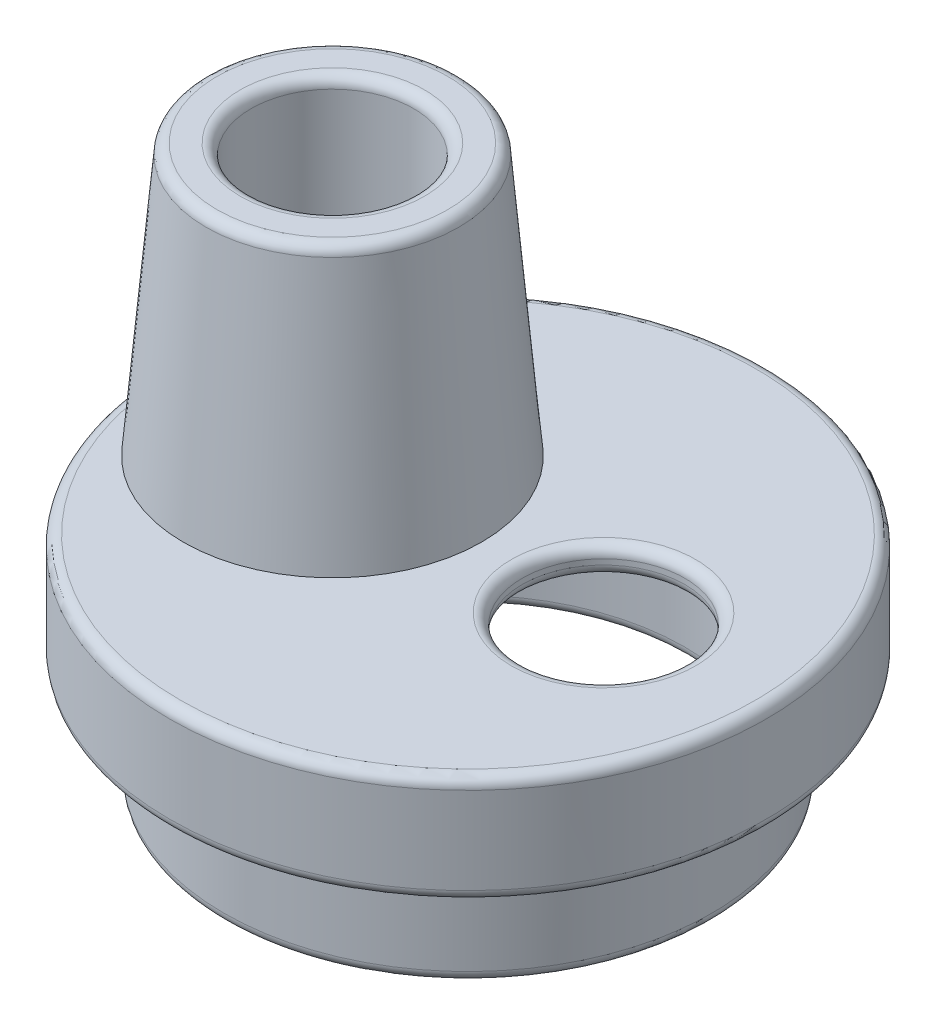
ISO-10303-21;
HEADER;
FILE_DESCRIPTION(('STEP AP214'),'2;1');
FILE_NAME('part.step','',(''),(''),'','','');
FILE_SCHEMA(('AUTOMOTIVE_DESIGN { 1 0 10303 214 1 1 1 1 }'));
ENDSEC;
DATA;
#1=APPLICATION_CONTEXT('core data for automotive mechanical design processes');
#2=APPLICATION_PROTOCOL_DEFINITION('international standard','automotive_design',2000,#1);
#3=PRODUCT_CONTEXT('',#1,'mechanical');
#4=PRODUCT('Part','Part','',(#3));
#5=PRODUCT_RELATED_PRODUCT_CATEGORY('part','',(#4));
#6=PRODUCT_DEFINITION_FORMATION('','',#4);
#7=PRODUCT_DEFINITION_CONTEXT('part definition',#1,'design');
#8=PRODUCT_DEFINITION('design','',#6,#7);
#9=PRODUCT_DEFINITION_SHAPE('','',#8);
#10=(LENGTH_UNIT() NAMED_UNIT(*) SI_UNIT(.MILLI.,.METRE.));
#11=(NAMED_UNIT(*) PLANE_ANGLE_UNIT() SI_UNIT($,.RADIAN.));
#12=(NAMED_UNIT(*) SI_UNIT($,.STERADIAN.) SOLID_ANGLE_UNIT());
#13=UNCERTAINTY_MEASURE_WITH_UNIT(LENGTH_MEASURE(1.E-05),#10,'distance_accuracy_value','');
#14=(GEOMETRIC_REPRESENTATION_CONTEXT(3) GLOBAL_UNCERTAINTY_ASSIGNED_CONTEXT((#13)) GLOBAL_UNIT_ASSIGNED_CONTEXT((#10,
#11,#12)) REPRESENTATION_CONTEXT('',''));
#15=CARTESIAN_POINT('',(0.,0.,0.));
#16=DIRECTION('',(0.,0.,1.));
#17=DIRECTION('',(1.,0.,0.));
#18=AXIS2_PLACEMENT_3D('',#15,#16,#17);
#19=CARTESIAN_POINT('',(0.,0.,0.));
#20=DIRECTION('',(0.,1.,0.));
#21=DIRECTION('',(0.,0.,1.));
#22=AXIS2_PLACEMENT_3D('',#19,#20,#21);
#23=PLANE('',#22);
#24=CARTESIAN_POINT('',(2.5,0.,0.));
#25=DIRECTION('',(0.,1.,0.));
#26=DIRECTION('',(0.,0.,1.));
#27=AXIS2_PLACEMENT_3D('',#24,#25,#26);
#28=CIRCLE('',#27,1.7);
#29=CARTESIAN_POINT('',(2.5,0.,1.7));
#30=VERTEX_POINT('',#29);
#31=EDGE_CURVE('E47',#30,#30,#28,.F.);
#32=ORIENTED_EDGE('',*,*,#31,.T.);
#33=EDGE_LOOP('',(#32));
#34=FACE_BOUND('',#33,.T.);
#35=CARTESIAN_POINT('',(0.,0.,0.));
#36=DIRECTION('',(0.,1.,0.));
#37=DIRECTION('',(0.,0.,1.));
#38=AXIS2_PLACEMENT_3D('',#35,#36,#37);
#39=CIRCLE('',#38,5.3);
#40=CARTESIAN_POINT('',(0.,0.,5.3));
#41=VERTEX_POINT('',#40);
#42=EDGE_CURVE('E52',#41,#41,#39,.T.);
#43=ORIENTED_EDGE('',*,*,#42,.T.);
#44=EDGE_LOOP('',(#43));
#45=FACE_BOUND('',#44,.T.);
#46=CARTESIAN_POINT('',(-2.5,0.,0.));
#47=DIRECTION('',(0.,1.,0.));
#48=DIRECTION('',(0.,0.,1.));
#49=AXIS2_PLACEMENT_3D('',#46,#47,#48);
#50=CIRCLE('',#49,2.75);
#51=CARTESIAN_POINT('',(-2.5,0.,2.75));
#52=VERTEX_POINT('',#51);
#53=EDGE_CURVE('E106',#52,#52,#50,.T.);
#54=ORIENTED_EDGE('',*,*,#53,.F.);
#55=EDGE_LOOP('',(#54));
#56=FACE_BOUND('',#55,.T.);
#57=ADVANCED_FACE('F32',(#34,#45,#56),#23,.T.);
#58=CARTESIAN_POINT('',(0.,0.,0.));
#59=DIRECTION('',(0.,1.,0.));
#60=DIRECTION('',(0.,0.,1.));
#61=AXIS2_PLACEMENT_3D('',#58,#59,#60);
#62=CYLINDRICAL_SURFACE('',#61,5.5);
#63=CARTESIAN_POINT('',(0.,-1.8,0.));
#64=DIRECTION('',(0.,-1.,0.));
#65=DIRECTION('',(0.,0.,-1.));
#66=AXIS2_PLACEMENT_3D('',#63,#64,#65);
#67=CIRCLE('',#66,5.5);
#68=CARTESIAN_POINT('',(0.,-1.8,-5.5));
#69=VERTEX_POINT('',#68);
#70=EDGE_CURVE('E64',#69,#69,#67,.F.);
#71=ORIENTED_EDGE('',*,*,#70,.T.);
#72=EDGE_LOOP('',(#71));
#73=FACE_BOUND('',#72,.T.);
#74=CARTESIAN_POINT('',(0.,-0.2,0.));
#75=DIRECTION('',(0.,1.,0.));
#76=DIRECTION('',(0.,0.,1.));
#77=AXIS2_PLACEMENT_3D('',#74,#75,#76);
#78=CIRCLE('',#77,5.5);
#79=CARTESIAN_POINT('',(0.,-0.200000000000001,5.5));
#80=VERTEX_POINT('',#79);
#81=EDGE_CURVE('E67',#80,#80,#78,.F.);
#82=ORIENTED_EDGE('',*,*,#81,.T.);
#83=EDGE_LOOP('',(#82));
#84=FACE_BOUND('',#83,.T.);
#85=ADVANCED_FACE('F113',(#73,#84),#62,.T.);
#86=CARTESIAN_POINT('',(0.,-2.,5.5));
#87=DIRECTION('',(0.,-1.,0.));
#88=DIRECTION('',(0.,0.,-1.));
#89=AXIS2_PLACEMENT_3D('',#86,#87,#88);
#90=PLANE('',#89);
#91=CARTESIAN_POINT('',(0.,-2.,0.));
#92=DIRECTION('',(0.,-1.,0.));
#93=DIRECTION('',(0.,0.,-1.));
#94=AXIS2_PLACEMENT_3D('',#91,#92,#93);
#95=CIRCLE('',#94,5.3);
#96=CARTESIAN_POINT('',(0.,-2.,-5.3));
#97=VERTEX_POINT('',#96);
#98=EDGE_CURVE('E61',#97,#97,#95,.T.);
#99=ORIENTED_EDGE('',*,*,#98,.T.);
#100=EDGE_LOOP('',(#99));
#101=FACE_BOUND('',#100,.T.);
#102=CARTESIAN_POINT('',(0.,-2.,0.));
#103=DIRECTION('',(0.,1.,0.));
#104=DIRECTION('',(0.,0.,1.));
#105=AXIS2_PLACEMENT_3D('',#102,#103,#104);
#106=CIRCLE('',#105,4.5);
#107=CARTESIAN_POINT('',(0.,-2.,4.5));
#108=VERTEX_POINT('',#107);
#109=EDGE_CURVE('E94',#108,#108,#106,.T.);
#110=ORIENTED_EDGE('',*,*,#109,.T.);
#111=EDGE_LOOP('',(#110));
#112=FACE_BOUND('',#111,.T.);
#113=ADVANCED_FACE('F119',(#101,#112),#90,.T.);
#114=CARTESIAN_POINT('',(0.,0.,0.));
#115=DIRECTION('',(0.,1.,0.));
#116=DIRECTION('',(0.,0.,1.));
#117=AXIS2_PLACEMENT_3D('',#114,#115,#116);
#118=CYLINDRICAL_SURFACE('',#117,4.5);
#119=CARTESIAN_POINT('',(0.,-3.8,0.));
#120=DIRECTION('',(0.,-1.,0.));
#121=DIRECTION('',(0.,0.,-1.));
#122=AXIS2_PLACEMENT_3D('',#119,#120,#121);
#123=CIRCLE('',#122,4.5);
#124=CARTESIAN_POINT('',(0.,-3.8,-4.5));
#125=VERTEX_POINT('',#124);
#126=EDGE_CURVE('E70',#125,#125,#123,.F.);
#127=ORIENTED_EDGE('',*,*,#126,.T.);
#128=EDGE_LOOP('',(#127));
#129=FACE_BOUND('',#128,.T.);
#130=ORIENTED_EDGE('',*,*,#109,.F.);
#131=EDGE_LOOP('',(#130));
#132=FACE_BOUND('',#131,.T.);
#133=ADVANCED_FACE('F198',(#129,#132),#118,.T.);
#134=CARTESIAN_POINT('',(0.,-4.,4.));
#135=DIRECTION('',(0.,-1.,0.));
#136=DIRECTION('',(0.,0.,-1.));
#137=AXIS2_PLACEMENT_3D('',#134,#135,#136);
#138=PLANE('',#137);
#139=CARTESIAN_POINT('',(0.,-4.,0.));
#140=DIRECTION('',(0.,-1.,0.));
#141=DIRECTION('',(0.,0.,-1.));
#142=AXIS2_PLACEMENT_3D('',#139,#140,#141);
#143=CIRCLE('',#142,4.2);
#144=CARTESIAN_POINT('',(0.,-4.,-4.2));
#145=VERTEX_POINT('',#144);
#146=EDGE_CURVE('E76',#145,#145,#143,.F.);
#147=ORIENTED_EDGE('',*,*,#146,.T.);
#148=EDGE_LOOP('',(#147));
#149=FACE_BOUND('',#148,.T.);
#150=CARTESIAN_POINT('',(0.,-4.,0.));
#151=DIRECTION('',(0.,-1.,0.));
#152=DIRECTION('',(0.,0.,-1.));
#153=AXIS2_PLACEMENT_3D('',#150,#151,#152);
#154=CIRCLE('',#153,4.3);
#155=CARTESIAN_POINT('',(0.,-4.,-4.3));
#156=VERTEX_POINT('',#155);
#157=EDGE_CURVE('E79',#156,#156,#154,.T.);
#158=ORIENTED_EDGE('',*,*,#157,.T.);
#159=EDGE_LOOP('',(#158));
#160=FACE_BOUND('',#159,.T.);
#161=ADVANCED_FACE('F194',(#149,#160),#138,.T.);
#162=CARTESIAN_POINT('',(0.,0.,0.));
#163=DIRECTION('',(0.,1.,0.));
#164=DIRECTION('',(0.,0.,1.));
#165=AXIS2_PLACEMENT_3D('',#162,#163,#164);
#166=CYLINDRICAL_SURFACE('',#165,4.);
#167=CARTESIAN_POINT('',(0.,-3.8,0.));
#168=DIRECTION('',(0.,-1.,0.));
#169=DIRECTION('',(0.,0.,-1.));
#170=AXIS2_PLACEMENT_3D('',#167,#168,#169);
#171=CIRCLE('',#170,4.);
#172=CARTESIAN_POINT('',(0.,-3.8,-4.));
#173=VERTEX_POINT('',#172);
#174=EDGE_CURVE('E73',#173,#173,#171,.T.);
#175=ORIENTED_EDGE('',*,*,#174,.T.);
#176=EDGE_LOOP('',(#175));
#177=FACE_BOUND('',#176,.T.);
#178=CARTESIAN_POINT('',(0.,-1.5,0.));
#179=DIRECTION('',(0.,1.,0.));
#180=DIRECTION('',(0.,0.,1.));
#181=AXIS2_PLACEMENT_3D('',#178,#179,#180);
#182=CIRCLE('',#181,4.);
#183=CARTESIAN_POINT('',(0.,-1.5,4.));
#184=VERTEX_POINT('',#183);
#185=EDGE_CURVE('E97',#184,#184,#182,.T.);
#186=ORIENTED_EDGE('',*,*,#185,.T.);
#187=EDGE_LOOP('',(#186));
#188=FACE_BOUND('',#187,.T.);
#189=ADVANCED_FACE('F190',(#177,#188),#166,.F.);
#190=CARTESIAN_POINT('',(0.,-1.5,5.));
#191=DIRECTION('',(0.,1.,0.));
#192=DIRECTION('',(0.,0.,1.));
#193=AXIS2_PLACEMENT_3D('',#190,#191,#192);
#194=PLANE('',#193);
#195=CARTESIAN_POINT('',(0.,-1.5,0.));
#196=DIRECTION('',(0.,1.,0.));
#197=DIRECTION('',(0.,0.,1.));
#198=AXIS2_PLACEMENT_3D('',#195,#196,#197);
#199=CIRCLE('',#198,5.);
#200=CARTESIAN_POINT('',(0.,-1.5,5.));
#201=VERTEX_POINT('',#200);
#202=EDGE_CURVE('E100',#201,#201,#199,.T.);
#203=ORIENTED_EDGE('',*,*,#202,.T.);
#204=EDGE_LOOP('',(#203));
#205=FACE_BOUND('',#204,.T.);
#206=ORIENTED_EDGE('',*,*,#185,.F.);
#207=EDGE_LOOP('',(#206));
#208=FACE_BOUND('',#207,.T.);
#209=ADVANCED_FACE('F186',(#205,#208),#194,.T.);
#210=CARTESIAN_POINT('',(0.,0.,0.));
#211=DIRECTION('',(0.,1.,0.));
#212=DIRECTION('',(0.,0.,1.));
#213=AXIS2_PLACEMENT_3D('',#210,#211,#212);
#214=CYLINDRICAL_SURFACE('',#213,5.);
#215=CARTESIAN_POINT('',(0.,-0.499999999999999,0.));
#216=DIRECTION('',(0.,1.,0.));
#217=DIRECTION('',(0.,0.,1.));
#218=AXIS2_PLACEMENT_3D('',#215,#216,#217);
#219=CIRCLE('',#218,5.);
#220=CARTESIAN_POINT('',(0.,-0.5,5.));
#221=VERTEX_POINT('',#220);
#222=EDGE_CURVE('E103',#221,#221,#219,.T.);
#223=ORIENTED_EDGE('',*,*,#222,.T.);
#224=EDGE_LOOP('',(#223));
#225=FACE_BOUND('',#224,.T.);
#226=ORIENTED_EDGE('',*,*,#202,.F.);
#227=EDGE_LOOP('',(#226));
#228=FACE_BOUND('',#227,.T.);
#229=ADVANCED_FACE('F182',(#225,#228),#214,.F.);
#230=CARTESIAN_POINT('',(0.,-0.5,0.));
#231=DIRECTION('',(0.,-1.,0.));
#232=DIRECTION('',(0.,0.,-1.));
#233=AXIS2_PLACEMENT_3D('',#230,#231,#232);
#234=PLANE('',#233);
#235=CARTESIAN_POINT('',(-2.5,-0.5,0.));
#236=DIRECTION('',(0.,-1.,0.));
#237=DIRECTION('',(0.,0.,-1.));
#238=AXIS2_PLACEMENT_3D('',#235,#236,#237);
#239=CIRCLE('',#238,1.7);
#240=CARTESIAN_POINT('',(-2.5,-0.499999999999999,-1.7));
#241=VERTEX_POINT('',#240);
#242=EDGE_CURVE('E88',#241,#241,#239,.F.);
#243=ORIENTED_EDGE('',*,*,#242,.T.);
#244=EDGE_LOOP('',(#243));
#245=FACE_BOUND('',#244,.T.);
#246=CARTESIAN_POINT('',(2.5,-0.5,0.));
#247=DIRECTION('',(0.,-1.,0.));
#248=DIRECTION('',(0.,0.,-1.));
#249=AXIS2_PLACEMENT_3D('',#246,#247,#248);
#250=CIRCLE('',#249,1.7);
#251=CARTESIAN_POINT('',(2.5,-0.499999999999999,-1.7));
#252=VERTEX_POINT('',#251);
#253=EDGE_CURVE('E91',#252,#252,#250,.F.);
#254=ORIENTED_EDGE('',*,*,#253,.T.);
#255=EDGE_LOOP('',(#254));
#256=FACE_BOUND('',#255,.T.);
#257=ORIENTED_EDGE('',*,*,#222,.F.);
#258=EDGE_LOOP('',(#257));
#259=FACE_BOUND('',#258,.T.);
#260=ADVANCED_FACE('F176',(#245,#256,#259),#234,.T.);
#261=CARTESIAN_POINT('',(2.5,-4.001,0.));
#262=DIRECTION('',(0.,1.,0.));
#263=DIRECTION('',(0.,0.,1.));
#264=AXIS2_PLACEMENT_3D('',#261,#262,#263);
#265=CYLINDRICAL_SURFACE('',#264,1.5);
#266=CARTESIAN_POINT('',(2.5,-0.299999999999999,0.));
#267=DIRECTION('',(0.,-1.,0.));
#268=DIRECTION('',(0.,0.,-1.));
#269=AXIS2_PLACEMENT_3D('',#266,#267,#268);
#270=CIRCLE('',#269,1.5);
#271=CARTESIAN_POINT('',(2.5,-0.299999999999999,-1.5));
#272=VERTEX_POINT('',#271);
#273=EDGE_CURVE('E55',#272,#272,#270,.T.);
#274=ORIENTED_EDGE('',*,*,#273,.T.);
#275=EDGE_LOOP('',(#274));
#276=FACE_BOUND('',#275,.T.);
#277=CARTESIAN_POINT('',(2.5,-0.200000000000001,0.));
#278=DIRECTION('',(0.,1.,0.));
#279=DIRECTION('',(0.,0.,1.));
#280=AXIS2_PLACEMENT_3D('',#277,#278,#279);
#281=CIRCLE('',#280,1.5);
#282=CARTESIAN_POINT('',(2.5,-0.200000000000001,1.5));
#283=VERTEX_POINT('',#282);
#284=EDGE_CURVE('E58',#283,#283,#281,.T.);
#285=ORIENTED_EDGE('',*,*,#284,.T.);
#286=EDGE_LOOP('',(#285));
#287=FACE_BOUND('',#286,.T.);
#288=ADVANCED_FACE('F168',(#276,#287),#265,.F.);
#289=CARTESIAN_POINT('',(-2.5,-4.001,0.));
#290=DIRECTION('',(0.,1.,0.));
#291=DIRECTION('',(0.,0.,1.));
#292=AXIS2_PLACEMENT_3D('',#289,#290,#291);
#293=CYLINDRICAL_SURFACE('',#292,1.5);
#294=CARTESIAN_POINT('',(-2.5,-0.299999999999999,0.));
#295=DIRECTION('',(0.,-1.,0.));
#296=DIRECTION('',(0.,0.,-1.));
#297=AXIS2_PLACEMENT_3D('',#294,#295,#296);
#298=CIRCLE('',#297,1.5);
#299=CARTESIAN_POINT('',(-2.5,-0.299999999999999,-1.5));
#300=VERTEX_POINT('',#299);
#301=EDGE_CURVE('E82',#300,#300,#298,.T.);
#302=ORIENTED_EDGE('',*,*,#301,.T.);
#303=EDGE_LOOP('',(#302));
#304=FACE_BOUND('',#303,.T.);
#305=CARTESIAN_POINT('',(-2.5,4.8,0.));
#306=DIRECTION('',(0.,1.,0.));
#307=DIRECTION('',(0.,0.,1.));
#308=AXIS2_PLACEMENT_3D('',#305,#306,#307);
#309=CIRCLE('',#308,1.5);
#310=CARTESIAN_POINT('',(-2.5,4.8,1.5));
#311=VERTEX_POINT('',#310);
#312=EDGE_CURVE('E85',#311,#311,#309,.T.);
#313=ORIENTED_EDGE('',*,*,#312,.T.);
#314=EDGE_LOOP('',(#313));
#315=FACE_BOUND('',#314,.T.);
#316=ADVANCED_FACE('F166',(#304,#315),#293,.F.);
#317=CARTESIAN_POINT('',(-2.5,5.,0.));
#318=DIRECTION('',(0.,1.,0.));
#319=DIRECTION('',(0.,0.,1.));
#320=AXIS2_PLACEMENT_3D('',#317,#318,#319);
#321=PLANE('',#320);
#322=CARTESIAN_POINT('',(-2.5,5.,0.));
#323=DIRECTION('',(0.,1.,0.));
#324=DIRECTION('',(0.,0.,1.));
#325=AXIS2_PLACEMENT_3D('',#322,#323,#324);
#326=CIRCLE('',#325,2.12929044756689);
#327=CARTESIAN_POINT('',(-2.5,5.,2.1292904475669));
#328=VERTEX_POINT('',#327);
#329=EDGE_CURVE('E39',#328,#328,#326,.T.);
#330=ORIENTED_EDGE('',*,*,#329,.T.);
#331=EDGE_LOOP('',(#330));
#332=FACE_BOUND('',#331,.T.);
#333=CARTESIAN_POINT('',(-2.5,5.,0.));
#334=DIRECTION('',(0.,1.,0.));
#335=DIRECTION('',(0.,0.,1.));
#336=AXIS2_PLACEMENT_3D('',#333,#334,#335);
#337=CIRCLE('',#336,1.7);
#338=CARTESIAN_POINT('',(-2.5,5.,1.7));
#339=VERTEX_POINT('',#338);
#340=EDGE_CURVE('E43',#339,#339,#337,.F.);
#341=ORIENTED_EDGE('',*,*,#340,.T.);
#342=EDGE_LOOP('',(#341));
#343=FACE_BOUND('',#342,.T.);
#344=ADVANCED_FACE('F128',(#332,#343),#321,.T.);
#345=CARTESIAN_POINT('',(-2.5,0.,0.));
#346=DIRECTION('',(0.,-1.,0.));
#347=DIRECTION('',(0.,0.,1.));
#348=AXIS2_PLACEMENT_3D('',#345,#346,#347);
#349=CONICAL_SURFACE('',#348,2.75,0.0872664625997165);
#350=CARTESIAN_POINT('',(-2.5,4.81743114854953,0.));
#351=DIRECTION('',(0.,-1.,0.));
#352=DIRECTION('',(0.,0.,-1.));
#353=AXIS2_PLACEMENT_3D('',#350,#351,#352);
#354=CIRCLE('',#353,2.32852938718524);
#355=CARTESIAN_POINT('',(-2.5,4.81743114854953,-2.32852938718524));
#356=VERTEX_POINT('',#355);
#357=EDGE_CURVE('E10',#356,#356,#354,.T.);
#358=ORIENTED_EDGE('',*,*,#357,.T.);
#359=EDGE_LOOP('',(#358));
#360=FACE_BOUND('',#359,.T.);
#361=ORIENTED_EDGE('',*,*,#53,.T.);
#362=EDGE_LOOP('',(#361));
#363=FACE_BOUND('',#362,.T.);
#364=ADVANCED_FACE('F110',(#360,#363),#349,.T.);
#365=CARTESIAN_POINT('',(-2.5,-0.3,0.));
#366=DIRECTION('',(0.,-1.,0.));
#367=DIRECTION('',(0.,0.,-1.));
#368=AXIS2_PLACEMENT_3D('',#365,#366,#367);
#369=TOROIDAL_SURFACE('',#368,1.7,0.2);
#370=ORIENTED_EDGE('',*,*,#301,.F.);
#371=EDGE_LOOP('',(#370));
#372=FACE_BOUND('',#371,.T.);
#373=ORIENTED_EDGE('',*,*,#242,.F.);
#374=EDGE_LOOP('',(#373));
#375=FACE_BOUND('',#374,.T.);
#376=ADVANCED_FACE('F127',(#372,#375),#369,.T.);
#377=CARTESIAN_POINT('',(0.,-3.8,0.));
#378=DIRECTION('',(0.,-1.,0.));
#379=DIRECTION('',(0.,0.,-1.));
#380=AXIS2_PLACEMENT_3D('',#377,#378,#379);
#381=TOROIDAL_SURFACE('',#380,4.2,0.2);
#382=ORIENTED_EDGE('',*,*,#174,.F.);
#383=EDGE_LOOP('',(#382));
#384=FACE_BOUND('',#383,.T.);
#385=ORIENTED_EDGE('',*,*,#146,.F.);
#386=EDGE_LOOP('',(#385));
#387=FACE_BOUND('',#386,.T.);
#388=ADVANCED_FACE('F131',(#384,#387),#381,.T.);
#389=CARTESIAN_POINT('',(0.,-3.8,0.));
#390=DIRECTION('',(0.,-1.,0.));
#391=DIRECTION('',(0.,0.,-1.));
#392=AXIS2_PLACEMENT_3D('',#389,#390,#391);
#393=TOROIDAL_SURFACE('',#392,4.3,0.2);
#394=ORIENTED_EDGE('',*,*,#157,.F.);
#395=EDGE_LOOP('',(#394));
#396=FACE_BOUND('',#395,.T.);
#397=ORIENTED_EDGE('',*,*,#126,.F.);
#398=EDGE_LOOP('',(#397));
#399=FACE_BOUND('',#398,.T.);
#400=ADVANCED_FACE('F135',(#396,#399),#393,.T.);
#401=CARTESIAN_POINT('',(0.,-1.8,0.));
#402=DIRECTION('',(0.,-1.,0.));
#403=DIRECTION('',(0.,0.,-1.));
#404=AXIS2_PLACEMENT_3D('',#401,#402,#403);
#405=TOROIDAL_SURFACE('',#404,5.3,0.2);
#406=ORIENTED_EDGE('',*,*,#98,.F.);
#407=EDGE_LOOP('',(#406));
#408=FACE_BOUND('',#407,.T.);
#409=ORIENTED_EDGE('',*,*,#70,.F.);
#410=EDGE_LOOP('',(#409));
#411=FACE_BOUND('',#410,.T.);
#412=ADVANCED_FACE('F139',(#408,#411),#405,.T.);
#413=CARTESIAN_POINT('',(2.5,-0.3,0.));
#414=DIRECTION('',(0.,-1.,0.));
#415=DIRECTION('',(0.,0.,-1.));
#416=AXIS2_PLACEMENT_3D('',#413,#414,#415);
#417=TOROIDAL_SURFACE('',#416,1.7,0.2);
#418=ORIENTED_EDGE('',*,*,#273,.F.);
#419=EDGE_LOOP('',(#418));
#420=FACE_BOUND('',#419,.T.);
#421=ORIENTED_EDGE('',*,*,#253,.F.);
#422=EDGE_LOOP('',(#421));
#423=FACE_BOUND('',#422,.T.);
#424=ADVANCED_FACE('F143',(#420,#423),#417,.T.);
#425=CARTESIAN_POINT('',(2.5,-0.2,0.));
#426=DIRECTION('',(0.,1.,0.));
#427=DIRECTION('',(0.,0.,1.));
#428=AXIS2_PLACEMENT_3D('',#425,#426,#427);
#429=TOROIDAL_SURFACE('',#428,1.7,0.2);
#430=ORIENTED_EDGE('',*,*,#31,.F.);
#431=EDGE_LOOP('',(#430));
#432=FACE_BOUND('',#431,.T.);
#433=ORIENTED_EDGE('',*,*,#284,.F.);
#434=EDGE_LOOP('',(#433));
#435=FACE_BOUND('',#434,.T.);
#436=ADVANCED_FACE('F147',(#432,#435),#429,.T.);
#437=CARTESIAN_POINT('',(-2.5,4.8,0.));
#438=DIRECTION('',(0.,1.,0.));
#439=DIRECTION('',(0.,0.,1.));
#440=AXIS2_PLACEMENT_3D('',#437,#438,#439);
#441=TOROIDAL_SURFACE('',#440,2.12929044756689,0.2);
#442=ORIENTED_EDGE('',*,*,#357,.F.);
#443=EDGE_LOOP('',(#442));
#444=FACE_BOUND('',#443,.T.);
#445=ORIENTED_EDGE('',*,*,#329,.F.);
#446=EDGE_LOOP('',(#445));
#447=FACE_BOUND('',#446,.T.);
#448=ADVANCED_FACE('F151',(#444,#447),#441,.T.);
#449=CARTESIAN_POINT('',(-2.5,4.8,0.));
#450=DIRECTION('',(0.,1.,0.));
#451=DIRECTION('',(0.,0.,1.));
#452=AXIS2_PLACEMENT_3D('',#449,#450,#451);
#453=TOROIDAL_SURFACE('',#452,1.7,0.2);
#454=ORIENTED_EDGE('',*,*,#340,.F.);
#455=EDGE_LOOP('',(#454));
#456=FACE_BOUND('',#455,.T.);
#457=ORIENTED_EDGE('',*,*,#312,.F.);
#458=EDGE_LOOP('',(#457));
#459=FACE_BOUND('',#458,.T.);
#460=ADVANCED_FACE('F154',(#456,#459),#453,.T.);
#461=CARTESIAN_POINT('',(0.,-0.2,0.));
#462=DIRECTION('',(0.,1.,0.));
#463=DIRECTION('',(0.,0.,1.));
#464=AXIS2_PLACEMENT_3D('',#461,#462,#463);
#465=TOROIDAL_SURFACE('',#464,5.3,0.2);
#466=ORIENTED_EDGE('',*,*,#81,.F.);
#467=EDGE_LOOP('',(#466));
#468=FACE_BOUND('',#467,.T.);
#469=ORIENTED_EDGE('',*,*,#42,.F.);
#470=EDGE_LOOP('',(#469));
#471=FACE_BOUND('',#470,.T.);
#472=ADVANCED_FACE('F34',(#468,#471),#465,.T.);
#473=CLOSED_SHELL('',(#57,#85,#113,#133,#161,#189,#209,#229,#260,#288,#316,#344,#364,#376,#388,
#400,#412,#424,#436,#448,#460,#472));
#474=MANIFOLD_SOLID_BREP('B2',#473);
#475=ADVANCED_BREP_SHAPE_REPRESENTATION('',(#18,#474),#14);
#476=SHAPE_DEFINITION_REPRESENTATION(#9,#475);
ENDSEC;
END-ISO-10303-21;
